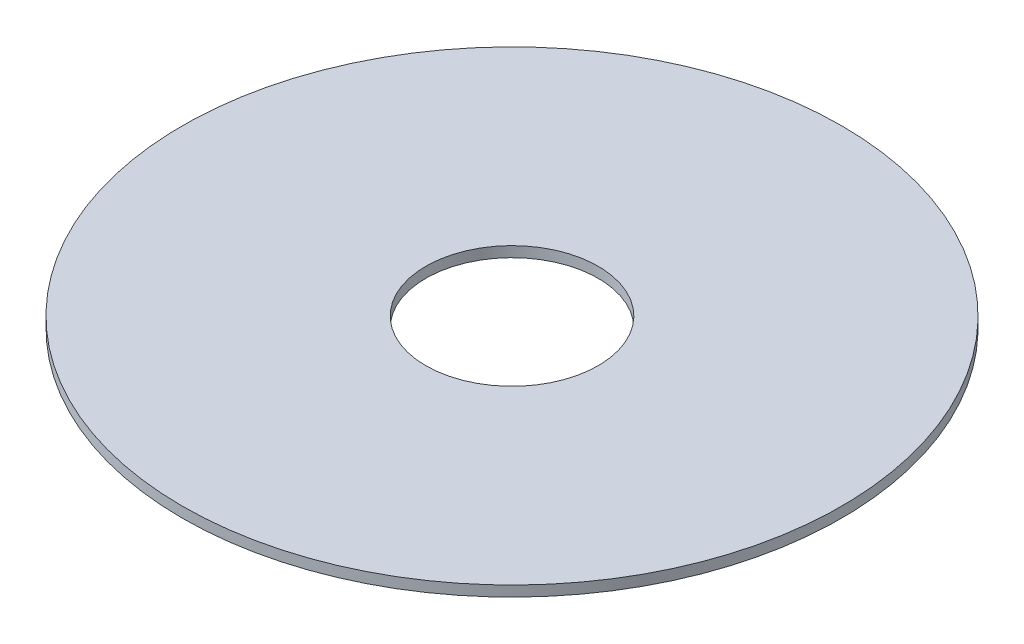
ISO-10303-21;
HEADER;
FILE_DESCRIPTION(('STEP AP214'),'2;1');
FILE_NAME('part.step','',(''),(''),'','','');
FILE_SCHEMA(('AUTOMOTIVE_DESIGN { 1 0 10303 214 1 1 1 1 }'));
ENDSEC;
DATA;
#1=APPLICATION_CONTEXT('core data for automotive mechanical design processes');
#2=APPLICATION_PROTOCOL_DEFINITION('international standard','automotive_design',2000,#1);
#3=PRODUCT_CONTEXT('',#1,'mechanical');
#4=PRODUCT('Part','Part','',(#3));
#5=PRODUCT_RELATED_PRODUCT_CATEGORY('part','',(#4));
#6=PRODUCT_DEFINITION_FORMATION('','',#4);
#7=PRODUCT_DEFINITION_CONTEXT('part definition',#1,'design');
#8=PRODUCT_DEFINITION('design','',#6,#7);
#9=PRODUCT_DEFINITION_SHAPE('','',#8);
#10=(LENGTH_UNIT() NAMED_UNIT(*) SI_UNIT(.MILLI.,.METRE.));
#11=(NAMED_UNIT(*) PLANE_ANGLE_UNIT() SI_UNIT($,.RADIAN.));
#12=(NAMED_UNIT(*) SI_UNIT($,.STERADIAN.) SOLID_ANGLE_UNIT());
#13=UNCERTAINTY_MEASURE_WITH_UNIT(LENGTH_MEASURE(1.E-05),#10,'distance_accuracy_value','');
#14=(GEOMETRIC_REPRESENTATION_CONTEXT(3) GLOBAL_UNCERTAINTY_ASSIGNED_CONTEXT((#13)) GLOBAL_UNIT_ASSIGNED_CONTEXT((#10,
#11,#12)) REPRESENTATION_CONTEXT('',''));
#15=CARTESIAN_POINT('',(0.,0.,0.));
#16=DIRECTION('',(0.,0.,1.));
#17=DIRECTION('',(1.,0.,0.));
#18=AXIS2_PLACEMENT_3D('',#15,#16,#17);
#19=CARTESIAN_POINT('',(0.,1.275,0.));
#20=DIRECTION('',(0.,1.,0.));
#21=DIRECTION('',(0.,0.,1.));
#22=AXIS2_PLACEMENT_3D('',#19,#20,#21);
#23=PLANE('',#22);
#24=CARTESIAN_POINT('',(0.,1.275,0.));
#25=DIRECTION('',(0.,1.,0.));
#26=DIRECTION('',(0.,0.,1.));
#27=AXIS2_PLACEMENT_3D('',#24,#25,#26);
#28=CIRCLE('',#27,26.7672);
#29=CARTESIAN_POINT('',(0.,1.275,26.7672));
#30=VERTEX_POINT('',#29);
#31=EDGE_CURVE('E10',#30,#30,#28,.T.);
#32=ORIENTED_EDGE('',*,*,#31,.T.);
#33=EDGE_LOOP('',(#32));
#34=FACE_BOUND('',#33,.T.);
#35=CARTESIAN_POINT('',(0.,1.275,0.));
#36=DIRECTION('',(0.,1.,0.));
#37=DIRECTION('',(0.,0.,1.));
#38=AXIS2_PLACEMENT_3D('',#35,#36,#37);
#39=CIRCLE('',#38,7.);
#40=CARTESIAN_POINT('',(0.,1.275,7.));
#41=VERTEX_POINT('',#40);
#42=EDGE_CURVE('E44',#41,#41,#39,.T.);
#43=ORIENTED_EDGE('',*,*,#42,.F.);
#44=EDGE_LOOP('',(#43));
#45=FACE_BOUND('',#44,.T.);
#46=ADVANCED_FACE('F33',(#34,#45),#23,.T.);
#47=CARTESIAN_POINT('',(0.,0.425,0.));
#48=DIRECTION('',(0.,1.,0.));
#49=DIRECTION('',(0.,0.,1.));
#50=AXIS2_PLACEMENT_3D('',#47,#48,#49);
#51=PLANE('',#50);
#52=CARTESIAN_POINT('',(0.,0.425,0.));
#53=DIRECTION('',(0.,1.,0.));
#54=DIRECTION('',(0.,0.,1.));
#55=AXIS2_PLACEMENT_3D('',#52,#53,#54);
#56=CIRCLE('',#55,26.7672);
#57=CARTESIAN_POINT('',(0.,0.425,26.7672));
#58=VERTEX_POINT('',#57);
#59=EDGE_CURVE('E37',#58,#58,#56,.T.);
#60=ORIENTED_EDGE('',*,*,#59,.F.);
#61=EDGE_LOOP('',(#60));
#62=FACE_BOUND('',#61,.T.);
#63=CARTESIAN_POINT('',(0.,0.425,0.));
#64=DIRECTION('',(0.,1.,0.));
#65=DIRECTION('',(0.,0.,1.));
#66=AXIS2_PLACEMENT_3D('',#63,#64,#65);
#67=CIRCLE('',#66,7.);
#68=CARTESIAN_POINT('',(0.,0.425,7.));
#69=VERTEX_POINT('',#68);
#70=EDGE_CURVE('E46',#69,#69,#67,.T.);
#71=ORIENTED_EDGE('',*,*,#70,.T.);
#72=EDGE_LOOP('',(#71));
#73=FACE_BOUND('',#72,.T.);
#74=ADVANCED_FACE('F56',(#62,#73),#51,.F.);
#75=CARTESIAN_POINT('',(0.,1.275,0.));
#76=DIRECTION('',(0.,-1.,0.));
#77=DIRECTION('',(0.,0.,-1.));
#78=AXIS2_PLACEMENT_3D('',#75,#76,#77);
#79=CYLINDRICAL_SURFACE('',#78,26.7672);
#80=ORIENTED_EDGE('',*,*,#31,.F.);
#81=EDGE_LOOP('',(#80));
#82=FACE_BOUND('',#81,.T.);
#83=ORIENTED_EDGE('',*,*,#59,.T.);
#84=EDGE_LOOP('',(#83));
#85=FACE_BOUND('',#84,.T.);
#86=ADVANCED_FACE('F35',(#82,#85),#79,.T.);
#87=CARTESIAN_POINT('',(0.,1.275,0.));
#88=DIRECTION('',(0.,-1.,0.));
#89=DIRECTION('',(0.,0.,-1.));
#90=AXIS2_PLACEMENT_3D('',#87,#88,#89);
#91=CYLINDRICAL_SURFACE('',#90,7.);
#92=ORIENTED_EDGE('',*,*,#42,.T.);
#93=EDGE_LOOP('',(#92));
#94=FACE_BOUND('',#93,.T.);
#95=ORIENTED_EDGE('',*,*,#70,.F.);
#96=EDGE_LOOP('',(#95));
#97=FACE_BOUND('',#96,.T.);
#98=ADVANCED_FACE('F52',(#94,#97),#91,.F.);
#99=CLOSED_SHELL('',(#46,#74,#86,#98));
#100=MANIFOLD_SOLID_BREP('B2',#99);
#101=ADVANCED_BREP_SHAPE_REPRESENTATION('',(#18,#100),#14);
#102=SHAPE_DEFINITION_REPRESENTATION(#9,#101);
ENDSEC;
END-ISO-10303-21;
